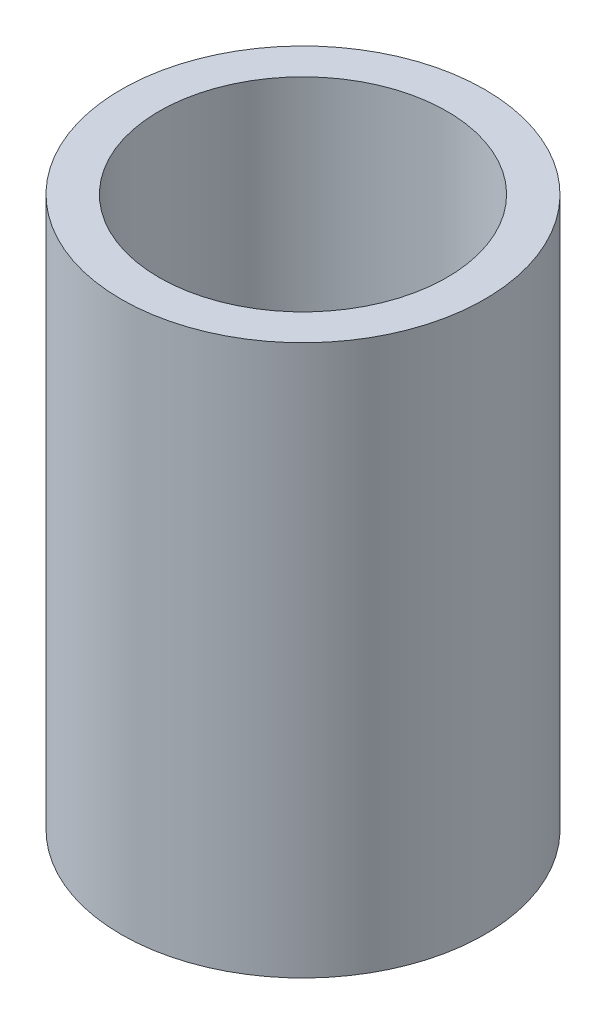
ISO-10303-21;
HEADER;
FILE_DESCRIPTION(('STEP AP214'),'2;1');
FILE_NAME('part.step','',(''),(''),'','','');
FILE_SCHEMA(('AUTOMOTIVE_DESIGN { 1 0 10303 214 1 1 1 1 }'));
ENDSEC;
DATA;
#1=APPLICATION_CONTEXT('core data for automotive mechanical design processes');
#2=APPLICATION_PROTOCOL_DEFINITION('international standard','automotive_design',2000,#1);
#3=PRODUCT_CONTEXT('',#1,'mechanical');
#4=PRODUCT('Part','Part','',(#3));
#5=PRODUCT_RELATED_PRODUCT_CATEGORY('part','',(#4));
#6=PRODUCT_DEFINITION_FORMATION('','',#4);
#7=PRODUCT_DEFINITION_CONTEXT('part definition',#1,'design');
#8=PRODUCT_DEFINITION('design','',#6,#7);
#9=PRODUCT_DEFINITION_SHAPE('','',#8);
#10=(LENGTH_UNIT() NAMED_UNIT(*) SI_UNIT(.MILLI.,.METRE.));
#11=(NAMED_UNIT(*) PLANE_ANGLE_UNIT() SI_UNIT($,.RADIAN.));
#12=(NAMED_UNIT(*) SI_UNIT($,.STERADIAN.) SOLID_ANGLE_UNIT());
#13=UNCERTAINTY_MEASURE_WITH_UNIT(LENGTH_MEASURE(1.E-05),#10,'distance_accuracy_value','');
#14=(GEOMETRIC_REPRESENTATION_CONTEXT(3) GLOBAL_UNCERTAINTY_ASSIGNED_CONTEXT((#13)) GLOBAL_UNIT_ASSIGNED_CONTEXT((#10,
#11,#12)) REPRESENTATION_CONTEXT('',''));
#15=CARTESIAN_POINT('',(0.,0.,0.));
#16=DIRECTION('',(0.,0.,1.));
#17=DIRECTION('',(1.,0.,0.));
#18=AXIS2_PLACEMENT_3D('',#15,#16,#17);
#19=CARTESIAN_POINT('',(0.,83.244204936994,0.));
#20=DIRECTION('',(0.,-1.,0.));
#21=DIRECTION('',(0.,0.,-1.));
#22=AXIS2_PLACEMENT_3D('',#19,#20,#21);
#23=CYLINDRICAL_SURFACE('',#22,27.5);
#24=CARTESIAN_POINT('',(0.,83.244204936994,0.));
#25=DIRECTION('',(0.,1.,0.));
#26=DIRECTION('',(0.,0.,1.));
#27=AXIS2_PLACEMENT_3D('',#24,#25,#26);
#28=CIRCLE('',#27,27.5);
#29=CARTESIAN_POINT('',(0.,83.244204936994,27.5));
#30=VERTEX_POINT('',#29);
#31=EDGE_CURVE('E10',#30,#30,#28,.T.);
#32=ORIENTED_EDGE('',*,*,#31,.F.);
#33=EDGE_LOOP('',(#32));
#34=FACE_BOUND('',#33,.T.);
#35=CARTESIAN_POINT('',(0.,0.,0.));
#36=DIRECTION('',(0.,1.,0.));
#37=DIRECTION('',(0.,0.,1.));
#38=AXIS2_PLACEMENT_3D('',#35,#36,#37);
#39=CIRCLE('',#38,27.5);
#40=CARTESIAN_POINT('',(0.,0.,27.5));
#41=VERTEX_POINT('',#40);
#42=EDGE_CURVE('E37',#41,#41,#39,.T.);
#43=ORIENTED_EDGE('',*,*,#42,.T.);
#44=EDGE_LOOP('',(#43));
#45=FACE_BOUND('',#44,.T.);
#46=ADVANCED_FACE('F40',(#34,#45),#23,.T.);
#47=CARTESIAN_POINT('',(0.,83.244204936994,0.));
#48=DIRECTION('',(0.,1.,0.));
#49=DIRECTION('',(0.,0.,1.));
#50=AXIS2_PLACEMENT_3D('',#47,#48,#49);
#51=PLANE('',#50);
#52=CARTESIAN_POINT('',(0.,83.244204936994,0.));
#53=DIRECTION('',(0.,1.,0.));
#54=DIRECTION('',(0.,0.,1.));
#55=AXIS2_PLACEMENT_3D('',#52,#53,#54);
#56=CIRCLE('',#55,21.7865915681557);
#57=CARTESIAN_POINT('',(0.,83.244204936994,21.7865915681557));
#58=VERTEX_POINT('',#57);
#59=EDGE_CURVE('E50',#58,#58,#56,.T.);
#60=ORIENTED_EDGE('',*,*,#59,.F.);
#61=EDGE_LOOP('',(#60));
#62=FACE_BOUND('',#61,.T.);
#63=ORIENTED_EDGE('',*,*,#31,.T.);
#64=EDGE_LOOP('',(#63));
#65=FACE_BOUND('',#64,.T.);
#66=ADVANCED_FACE('F59',(#62,#65),#51,.T.);
#67=CARTESIAN_POINT('',(0.,0.,0.));
#68=DIRECTION('',(0.,1.,0.));
#69=DIRECTION('',(0.,0.,1.));
#70=AXIS2_PLACEMENT_3D('',#67,#68,#69);
#71=PLANE('',#70);
#72=CARTESIAN_POINT('',(0.,0.,0.));
#73=DIRECTION('',(0.,1.,0.));
#74=DIRECTION('',(0.,0.,1.));
#75=AXIS2_PLACEMENT_3D('',#72,#73,#74);
#76=CIRCLE('',#75,21.7865915681557);
#77=CARTESIAN_POINT('',(0.,0.,21.7865915681557));
#78=VERTEX_POINT('',#77);
#79=EDGE_CURVE('E47',#78,#78,#76,.T.);
#80=ORIENTED_EDGE('',*,*,#79,.T.);
#81=EDGE_LOOP('',(#80));
#82=FACE_BOUND('',#81,.T.);
#83=ORIENTED_EDGE('',*,*,#42,.F.);
#84=EDGE_LOOP('',(#83));
#85=FACE_BOUND('',#84,.T.);
#86=ADVANCED_FACE('F58',(#82,#85),#71,.F.);
#87=CARTESIAN_POINT('',(0.,83.244204936994,0.));
#88=DIRECTION('',(0.,-1.,0.));
#89=DIRECTION('',(0.,0.,-1.));
#90=AXIS2_PLACEMENT_3D('',#87,#88,#89);
#91=CYLINDRICAL_SURFACE('',#90,21.7865915681557);
#92=ORIENTED_EDGE('',*,*,#59,.T.);
#93=EDGE_LOOP('',(#92));
#94=FACE_BOUND('',#93,.T.);
#95=ORIENTED_EDGE('',*,*,#79,.F.);
#96=EDGE_LOOP('',(#95));
#97=FACE_BOUND('',#96,.T.);
#98=ADVANCED_FACE('F54',(#94,#97),#91,.F.);
#99=CLOSED_SHELL('',(#46,#66,#86,#98));
#100=MANIFOLD_SOLID_BREP('B2',#99);
#101=ADVANCED_BREP_SHAPE_REPRESENTATION('',(#18,#100),#14);
#102=SHAPE_DEFINITION_REPRESENTATION(#9,#101);
ENDSEC;
END-ISO-10303-21;
